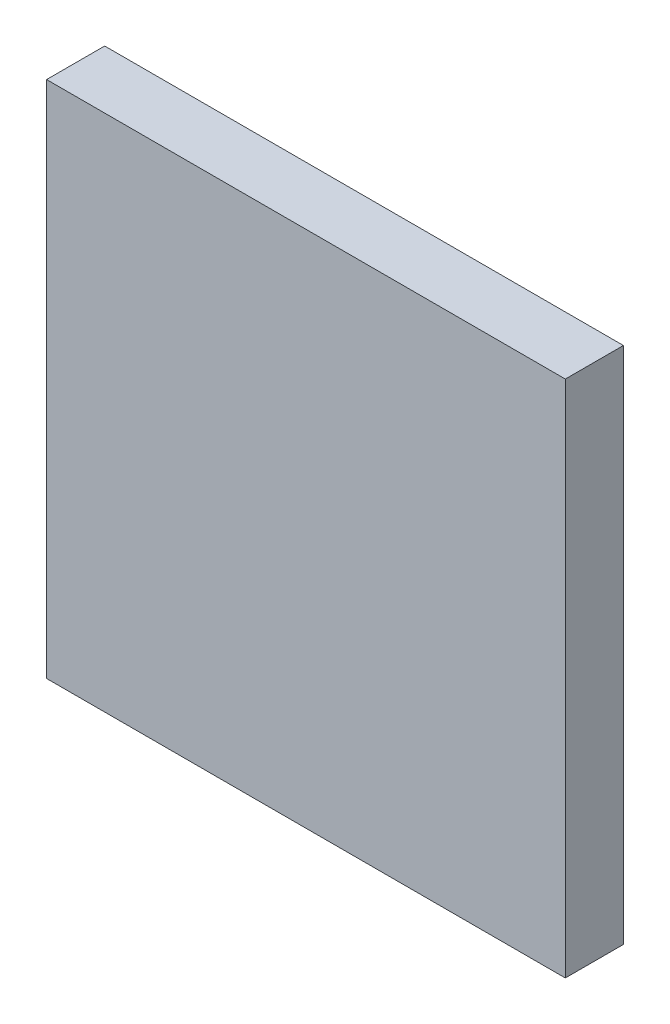
ISO-10303-21;
HEADER;
FILE_DESCRIPTION(('STEP AP214'),'2;1');
FILE_NAME('part.step','',(''),(''),'','','');
FILE_SCHEMA(('AUTOMOTIVE_DESIGN { 1 0 10303 214 1 1 1 1 }'));
ENDSEC;
DATA;
#1=APPLICATION_CONTEXT('core data for automotive mechanical design processes');
#2=APPLICATION_PROTOCOL_DEFINITION('international standard','automotive_design',2000,#1);
#3=PRODUCT_CONTEXT('',#1,'mechanical');
#4=PRODUCT('Part','Part','',(#3));
#5=PRODUCT_RELATED_PRODUCT_CATEGORY('part','',(#4));
#6=PRODUCT_DEFINITION_FORMATION('','',#4);
#7=PRODUCT_DEFINITION_CONTEXT('part definition',#1,'design');
#8=PRODUCT_DEFINITION('design','',#6,#7);
#9=PRODUCT_DEFINITION_SHAPE('','',#8);
#10=(LENGTH_UNIT() NAMED_UNIT(*) SI_UNIT(.MILLI.,.METRE.));
#11=(NAMED_UNIT(*) PLANE_ANGLE_UNIT() SI_UNIT($,.RADIAN.));
#12=(NAMED_UNIT(*) SI_UNIT($,.STERADIAN.) SOLID_ANGLE_UNIT());
#13=UNCERTAINTY_MEASURE_WITH_UNIT(LENGTH_MEASURE(1.E-05),#10,'distance_accuracy_value','');
#14=(GEOMETRIC_REPRESENTATION_CONTEXT(3) GLOBAL_UNCERTAINTY_ASSIGNED_CONTEXT((#13)) GLOBAL_UNIT_ASSIGNED_CONTEXT((#10,
#11,#12)) REPRESENTATION_CONTEXT('',''));
#15=CARTESIAN_POINT('',(0.,0.,0.));
#16=DIRECTION('',(0.,0.,1.));
#17=DIRECTION('',(1.,0.,0.));
#18=AXIS2_PLACEMENT_3D('',#15,#16,#17);
#19=CARTESIAN_POINT('',(0.,0.,0.));
#20=DIRECTION('',(0.,0.,1.));
#21=DIRECTION('',(1.,0.,0.));
#22=AXIS2_PLACEMENT_3D('',#19,#20,#21);
#23=PLANE('',#22);
#24=DIRECTION('',(0.,-1.,0.));
#25=VECTOR('',#24,1.);
#26=CARTESIAN_POINT('',(-0.635,-0.635,0.));
#27=LINE('',#26,#25);
#28=CARTESIAN_POINT('',(-0.635,5.03500009,0.));
#29=VERTEX_POINT('',#28);
#30=CARTESIAN_POINT('',(-0.635,-0.635,0.));
#31=VERTEX_POINT('',#30);
#32=EDGE_CURVE('E207',#29,#31,#27,.T.);
#33=ORIENTED_EDGE('',*,*,#32,.F.);
#34=DIRECTION('',(-1.,0.,0.));
#35=VECTOR('',#34,1.);
#36=CARTESIAN_POINT('',(5.03500009,5.03500009,0.));
#37=LINE('',#36,#35);
#38=CARTESIAN_POINT('',(5.03500009,5.03500009,0.));
#39=VERTEX_POINT('',#38);
#40=EDGE_CURVE('E201',#39,#29,#37,.T.);
#41=ORIENTED_EDGE('',*,*,#40,.F.);
#42=DIRECTION('',(0.,1.,0.));
#43=VECTOR('',#42,1.);
#44=CARTESIAN_POINT('',(5.03500009,-0.635,0.));
#45=LINE('',#44,#43);
#46=CARTESIAN_POINT('',(5.03500009,-0.635,0.));
#47=VERTEX_POINT('',#46);
#48=EDGE_CURVE('E210',#47,#39,#45,.T.);
#49=ORIENTED_EDGE('',*,*,#48,.F.);
#50=DIRECTION('',(1.,0.,0.));
#51=VECTOR('',#50,1.);
#52=CARTESIAN_POINT('',(5.03500009,-0.635,0.));
#53=LINE('',#52,#51);
#54=EDGE_CURVE('E193',#31,#47,#53,.T.);
#55=ORIENTED_EDGE('',*,*,#54,.F.);
#56=EDGE_LOOP('',(#33,#41,#49,#55));
#57=FACE_BOUND('',#56,.T.);
#58=DIRECTION('',(0.,-1.,0.));
#59=VECTOR('',#58,1.);
#60=CARTESIAN_POINT('',(4.40000008999999,0.,0.));
#61=LINE('',#60,#59);
#62=CARTESIAN_POINT('',(4.40000008999999,4.40000009,0.));
#63=VERTEX_POINT('',#62);
#64=CARTESIAN_POINT('',(4.40000008999999,3.520000072,0.));
#65=VERTEX_POINT('',#64);
#66=EDGE_CURVE('E11',#63,#65,#61,.T.);
#67=ORIENTED_EDGE('',*,*,#66,.F.);
#68=DIRECTION('',(1.,0.,0.));
#69=VECTOR('',#68,1.);
#70=CARTESIAN_POINT('',(0.,4.40000009,0.));
#71=LINE('',#70,#69);
#72=CARTESIAN_POINT('',(3.52000007199999,4.40000009,0.));
#73=VERTEX_POINT('',#72);
#74=EDGE_CURVE('E49',#73,#63,#71,.T.);
#75=ORIENTED_EDGE('',*,*,#74,.F.);
#76=DIRECTION('',(1.,0.,0.));
#77=VECTOR('',#76,1.);
#78=CARTESIAN_POINT('',(0.,4.40000009,0.));
#79=LINE('',#78,#77);
#80=CARTESIAN_POINT('',(2.64000005399999,4.40000009,0.));
#81=VERTEX_POINT('',#80);
#82=EDGE_CURVE('E402',#81,#73,#79,.T.);
#83=ORIENTED_EDGE('',*,*,#82,.F.);
#84=DIRECTION('',(1.,0.,0.));
#85=VECTOR('',#84,1.);
#86=CARTESIAN_POINT('',(0.,4.40000009,0.));
#87=LINE('',#86,#85);
#88=CARTESIAN_POINT('',(1.76000003599999,4.40000009,0.));
#89=VERTEX_POINT('',#88);
#90=EDGE_CURVE('E395',#89,#81,#87,.T.);
#91=ORIENTED_EDGE('',*,*,#90,.F.);
#92=DIRECTION('',(1.,0.,0.));
#93=VECTOR('',#92,1.);
#94=CARTESIAN_POINT('',(0.,4.40000009,0.));
#95=LINE('',#94,#93);
#96=CARTESIAN_POINT('',(0.880000017999987,4.40000009,0.));
#97=VERTEX_POINT('',#96);
#98=EDGE_CURVE('E384',#97,#89,#95,.T.);
#99=ORIENTED_EDGE('',*,*,#98,.F.);
#100=DIRECTION('',(1.,0.,0.));
#101=VECTOR('',#100,1.);
#102=CARTESIAN_POINT('',(0.,4.40000009,0.));
#103=LINE('',#102,#101);
#104=CARTESIAN_POINT('',(0.,4.40000009,0.));
#105=VERTEX_POINT('',#104);
#106=EDGE_CURVE('E385',#105,#97,#103,.T.);
#107=ORIENTED_EDGE('',*,*,#106,.F.);
#108=DIRECTION('',(0.,1.,0.));
#109=VECTOR('',#108,1.);
#110=CARTESIAN_POINT('',(0.,0.,0.));
#111=LINE('',#110,#109);
#112=CARTESIAN_POINT('',(0.,3.520000072,0.));
#113=VERTEX_POINT('',#112);
#114=EDGE_CURVE('E377',#113,#105,#111,.T.);
#115=ORIENTED_EDGE('',*,*,#114,.F.);
#116=DIRECTION('',(0.,1.,0.));
#117=VECTOR('',#116,1.);
#118=CARTESIAN_POINT('',(0.,0.,0.));
#119=LINE('',#118,#117);
#120=CARTESIAN_POINT('',(0.,2.640000054,0.));
#121=VERTEX_POINT('',#120);
#122=EDGE_CURVE('E344',#121,#113,#119,.T.);
#123=ORIENTED_EDGE('',*,*,#122,.F.);
#124=DIRECTION('',(0.,1.,0.));
#125=VECTOR('',#124,1.);
#126=CARTESIAN_POINT('',(0.,0.,0.));
#127=LINE('',#126,#125);
#128=CARTESIAN_POINT('',(0.,1.760000036,0.));
#129=VERTEX_POINT('',#128);
#130=EDGE_CURVE('E311',#129,#121,#127,.T.);
#131=ORIENTED_EDGE('',*,*,#130,.F.);
#132=DIRECTION('',(0.,1.,0.));
#133=VECTOR('',#132,1.);
#134=CARTESIAN_POINT('',(0.,0.,0.));
#135=LINE('',#134,#133);
#136=CARTESIAN_POINT('',(0.,0.880000018,0.));
#137=VERTEX_POINT('',#136);
#138=EDGE_CURVE('E280',#137,#129,#135,.T.);
#139=ORIENTED_EDGE('',*,*,#138,.F.);
#140=DIRECTION('',(0.,1.,0.));
#141=VECTOR('',#140,1.);
#142=CARTESIAN_POINT('',(0.,0.,0.));
#143=LINE('',#142,#141);
#144=CARTESIAN_POINT('',(0.,0.,0.));
#145=VERTEX_POINT('',#144);
#146=EDGE_CURVE('E243',#145,#137,#143,.T.);
#147=ORIENTED_EDGE('',*,*,#146,.F.);
#148=DIRECTION('',(-1.,0.,0.));
#149=VECTOR('',#148,1.);
#150=CARTESIAN_POINT('',(0.,0.,0.));
#151=LINE('',#150,#149);
#152=CARTESIAN_POINT('',(0.880000018,0.,0.));
#153=VERTEX_POINT('',#152);
#154=EDGE_CURVE('E239',#153,#145,#151,.T.);
#155=ORIENTED_EDGE('',*,*,#154,.F.);
#156=DIRECTION('',(-1.,0.,0.));
#157=VECTOR('',#156,1.);
#158=CARTESIAN_POINT('',(0.,0.,0.));
#159=LINE('',#158,#157);
#160=CARTESIAN_POINT('',(1.760000036,0.,0.));
#161=VERTEX_POINT('',#160);
#162=EDGE_CURVE('E255',#161,#153,#159,.T.);
#163=ORIENTED_EDGE('',*,*,#162,.F.);
#164=DIRECTION('',(-1.,0.,0.));
#165=VECTOR('',#164,1.);
#166=CARTESIAN_POINT('',(0.,0.,0.));
#167=LINE('',#166,#165);
#168=CARTESIAN_POINT('',(2.640000054,0.,0.));
#169=VERTEX_POINT('',#168);
#170=EDGE_CURVE('E266',#169,#161,#167,.T.);
#171=ORIENTED_EDGE('',*,*,#170,.F.);
#172=DIRECTION('',(-1.,0.,0.));
#173=VECTOR('',#172,1.);
#174=CARTESIAN_POINT('',(0.,0.,0.));
#175=LINE('',#174,#173);
#176=CARTESIAN_POINT('',(3.520000072,0.,0.));
#177=VERTEX_POINT('',#176);
#178=EDGE_CURVE('E296',#177,#169,#175,.T.);
#179=ORIENTED_EDGE('',*,*,#178,.F.);
#180=DIRECTION('',(-1.,0.,0.));
#181=VECTOR('',#180,1.);
#182=CARTESIAN_POINT('',(0.,0.,0.));
#183=LINE('',#182,#181);
#184=CARTESIAN_POINT('',(4.40000009,0.,0.));
#185=VERTEX_POINT('',#184);
#186=EDGE_CURVE('E414',#185,#177,#183,.T.);
#187=ORIENTED_EDGE('',*,*,#186,.F.);
#188=DIRECTION('',(0.,-1.,0.));
#189=VECTOR('',#188,1.);
#190=CARTESIAN_POINT('',(4.40000009,0.,0.));
#191=LINE('',#190,#189);
#192=CARTESIAN_POINT('',(4.40000009,0.880000018,0.));
#193=VERTEX_POINT('',#192);
#194=EDGE_CURVE('E418',#193,#185,#191,.T.);
#195=ORIENTED_EDGE('',*,*,#194,.F.);
#196=DIRECTION('',(0.,-1.,0.));
#197=VECTOR('',#196,1.);
#198=CARTESIAN_POINT('',(4.40000009,0.,0.));
#199=LINE('',#198,#197);
#200=CARTESIAN_POINT('',(4.40000009,1.760000036,0.));
#201=VERTEX_POINT('',#200);
#202=EDGE_CURVE('E425',#201,#193,#199,.T.);
#203=ORIENTED_EDGE('',*,*,#202,.F.);
#204=DIRECTION('',(0.,-1.,0.));
#205=VECTOR('',#204,1.);
#206=CARTESIAN_POINT('',(4.40000008999999,0.,0.));
#207=LINE('',#206,#205);
#208=CARTESIAN_POINT('',(4.40000008999999,2.640000054,0.));
#209=VERTEX_POINT('',#208);
#210=EDGE_CURVE('E432',#209,#201,#207,.T.);
#211=ORIENTED_EDGE('',*,*,#210,.F.);
#212=DIRECTION('',(0.,-1.,0.));
#213=VECTOR('',#212,1.);
#214=CARTESIAN_POINT('',(4.40000008999999,0.,0.));
#215=LINE('',#214,#213);
#216=EDGE_CURVE('E439',#65,#209,#215,.T.);
#217=ORIENTED_EDGE('',*,*,#216,.F.);
#218=EDGE_LOOP('',(#67,#75,#83,#91,#99,#107,#115,#123,#131,#139,#147,#155,#163,#171,#179,#187,
#195,#203,#211,#217));
#219=FACE_BOUND('',#218,.T.);
#220=ADVANCED_FACE('F45',(#57,#219),#23,.F.);
#221=ORIENTED_EDGE('',*,*,#74,.T.);
#222=ORIENTED_EDGE('',*,*,#66,.T.);
#223=DIRECTION('',(1.,0.,0.));
#224=VECTOR('',#223,1.);
#225=CARTESIAN_POINT('',(0.,3.520000072,0.));
#226=LINE('',#225,#224);
#227=CARTESIAN_POINT('',(3.52000007199999,3.520000072,0.));
#228=VERTEX_POINT('',#227);
#229=EDGE_CURVE('E435',#228,#65,#226,.T.);
#230=ORIENTED_EDGE('',*,*,#229,.F.);
#231=DIRECTION('',(0.,-1.,0.));
#232=VECTOR('',#231,1.);
#233=CARTESIAN_POINT('',(3.52000007199999,0.,0.));
#234=LINE('',#233,#232);
#235=EDGE_CURVE('E406',#73,#228,#234,.T.);
#236=ORIENTED_EDGE('',*,*,#235,.F.);
#237=EDGE_LOOP('',(#221,#222,#230,#236));
#238=FACE_BOUND('',#237,.T.);
#239=ADVANCED_FACE('F451',(#238),#23,.F.);
#240=ORIENTED_EDGE('',*,*,#229,.T.);
#241=ORIENTED_EDGE('',*,*,#216,.T.);
#242=DIRECTION('',(1.,0.,0.));
#243=VECTOR('',#242,1.);
#244=CARTESIAN_POINT('',(0.,2.640000054,0.));
#245=LINE('',#244,#243);
#246=CARTESIAN_POINT('',(3.52000007199999,2.640000054,0.));
#247=VERTEX_POINT('',#246);
#248=EDGE_CURVE('E428',#247,#209,#245,.T.);
#249=ORIENTED_EDGE('',*,*,#248,.F.);
#250=DIRECTION('',(0.,-1.,0.));
#251=VECTOR('',#250,1.);
#252=CARTESIAN_POINT('',(3.52000007199999,0.,0.));
#253=LINE('',#252,#251);
#254=EDGE_CURVE('E373',#228,#247,#253,.T.);
#255=ORIENTED_EDGE('',*,*,#254,.F.);
#256=EDGE_LOOP('',(#240,#241,#249,#255));
#257=FACE_BOUND('',#256,.T.);
#258=ADVANCED_FACE('F448',(#257),#23,.F.);
#259=ORIENTED_EDGE('',*,*,#248,.T.);
#260=ORIENTED_EDGE('',*,*,#210,.T.);
#261=DIRECTION('',(1.,0.,0.));
#262=VECTOR('',#261,1.);
#263=CARTESIAN_POINT('',(0.,1.760000036,0.));
#264=LINE('',#263,#262);
#265=CARTESIAN_POINT('',(3.520000072,1.760000036,0.));
#266=VERTEX_POINT('',#265);
#267=EDGE_CURVE('E417',#266,#201,#264,.T.);
#268=ORIENTED_EDGE('',*,*,#267,.F.);
#269=DIRECTION('',(0.,-1.,0.));
#270=VECTOR('',#269,1.);
#271=CARTESIAN_POINT('',(3.52000007199999,0.,0.));
#272=LINE('',#271,#270);
#273=EDGE_CURVE('E340',#247,#266,#272,.T.);
#274=ORIENTED_EDGE('',*,*,#273,.F.);
#275=EDGE_LOOP('',(#259,#260,#268,#274));
#276=FACE_BOUND('',#275,.T.);
#277=ADVANCED_FACE('F518',(#276),#23,.F.);
#278=ORIENTED_EDGE('',*,*,#267,.T.);
#279=ORIENTED_EDGE('',*,*,#202,.T.);
#280=DIRECTION('',(1.,0.,0.));
#281=VECTOR('',#280,1.);
#282=CARTESIAN_POINT('',(0.,0.880000018,0.));
#283=LINE('',#282,#281);
#284=CARTESIAN_POINT('',(3.520000072,0.880000018,0.));
#285=VERTEX_POINT('',#284);
#286=EDGE_CURVE('E410',#285,#193,#283,.T.);
#287=ORIENTED_EDGE('',*,*,#286,.F.);
#288=DIRECTION('',(0.,-1.,0.));
#289=VECTOR('',#288,1.);
#290=CARTESIAN_POINT('',(3.520000072,0.,0.));
#291=LINE('',#290,#289);
#292=EDGE_CURVE('E307',#266,#285,#291,.T.);
#293=ORIENTED_EDGE('',*,*,#292,.F.);
#294=EDGE_LOOP('',(#278,#279,#287,#293));
#295=FACE_BOUND('',#294,.T.);
#296=ADVANCED_FACE('F515',(#295),#23,.F.);
#297=ORIENTED_EDGE('',*,*,#194,.T.);
#298=ORIENTED_EDGE('',*,*,#186,.T.);
#299=DIRECTION('',(0.,-1.,0.));
#300=VECTOR('',#299,1.);
#301=CARTESIAN_POINT('',(3.520000072,0.,0.));
#302=LINE('',#301,#300);
#303=EDGE_CURVE('E292',#285,#177,#302,.T.);
#304=ORIENTED_EDGE('',*,*,#303,.F.);
#305=ORIENTED_EDGE('',*,*,#286,.T.);
#306=EDGE_LOOP('',(#297,#298,#304,#305));
#307=FACE_BOUND('',#306,.T.);
#308=ADVANCED_FACE('F510',(#307),#23,.F.);
#309=ORIENTED_EDGE('',*,*,#82,.T.);
#310=ORIENTED_EDGE('',*,*,#235,.T.);
#311=DIRECTION('',(1.,0.,0.));
#312=VECTOR('',#311,1.);
#313=CARTESIAN_POINT('',(0.,3.520000072,0.));
#314=LINE('',#313,#312);
#315=CARTESIAN_POINT('',(2.64000005399999,3.520000072,0.));
#316=VERTEX_POINT('',#315);
#317=EDGE_CURVE('E369',#316,#228,#314,.T.);
#318=ORIENTED_EDGE('',*,*,#317,.F.);
#319=DIRECTION('',(0.,-1.,0.));
#320=VECTOR('',#319,1.);
#321=CARTESIAN_POINT('',(2.64000005399999,0.,0.));
#322=LINE('',#321,#320);
#323=EDGE_CURVE('E399',#81,#316,#322,.T.);
#324=ORIENTED_EDGE('',*,*,#323,.F.);
#325=EDGE_LOOP('',(#309,#310,#318,#324));
#326=FACE_BOUND('',#325,.T.);
#327=ADVANCED_FACE('F454',(#326),#23,.F.);
#328=ORIENTED_EDGE('',*,*,#90,.T.);
#329=ORIENTED_EDGE('',*,*,#323,.T.);
#330=DIRECTION('',(1.,0.,0.));
#331=VECTOR('',#330,1.);
#332=CARTESIAN_POINT('',(0.,3.520000072,0.));
#333=LINE('',#332,#331);
#334=CARTESIAN_POINT('',(1.76000003599999,3.520000072,0.));
#335=VERTEX_POINT('',#334);
#336=EDGE_CURVE('E362',#335,#316,#333,.T.);
#337=ORIENTED_EDGE('',*,*,#336,.F.);
#338=DIRECTION('',(0.,-1.,0.));
#339=VECTOR('',#338,1.);
#340=CARTESIAN_POINT('',(1.76000003599999,0.,0.));
#341=LINE('',#340,#339);
#342=EDGE_CURVE('E392',#89,#335,#341,.T.);
#343=ORIENTED_EDGE('',*,*,#342,.F.);
#344=EDGE_LOOP('',(#328,#329,#337,#343));
#345=FACE_BOUND('',#344,.T.);
#346=ADVANCED_FACE('F468',(#345),#23,.F.);
#347=ORIENTED_EDGE('',*,*,#98,.T.);
#348=ORIENTED_EDGE('',*,*,#342,.T.);
#349=DIRECTION('',(1.,0.,0.));
#350=VECTOR('',#349,1.);
#351=CARTESIAN_POINT('',(0.,3.520000072,0.));
#352=LINE('',#351,#350);
#353=CARTESIAN_POINT('',(0.88000001799999,3.520000072,0.));
#354=VERTEX_POINT('',#353);
#355=EDGE_CURVE('E351',#354,#335,#352,.T.);
#356=ORIENTED_EDGE('',*,*,#355,.F.);
#357=DIRECTION('',(0.,-1.,0.));
#358=VECTOR('',#357,1.);
#359=CARTESIAN_POINT('',(0.880000017999987,0.,0.));
#360=LINE('',#359,#358);
#361=EDGE_CURVE('E381',#97,#354,#360,.T.);
#362=ORIENTED_EDGE('',*,*,#361,.F.);
#363=EDGE_LOOP('',(#347,#348,#356,#362));
#364=FACE_BOUND('',#363,.T.);
#365=ADVANCED_FACE('F472',(#364),#23,.F.);
#366=ORIENTED_EDGE('',*,*,#106,.T.);
#367=ORIENTED_EDGE('',*,*,#361,.T.);
#368=DIRECTION('',(1.,0.,0.));
#369=VECTOR('',#368,1.);
#370=CARTESIAN_POINT('',(0.,3.520000072,0.));
#371=LINE('',#370,#369);
#372=EDGE_CURVE('E352',#113,#354,#371,.T.);
#373=ORIENTED_EDGE('',*,*,#372,.F.);
#374=ORIENTED_EDGE('',*,*,#114,.T.);
#375=EDGE_LOOP('',(#366,#367,#373,#374));
#376=FACE_BOUND('',#375,.T.);
#377=ADVANCED_FACE('F476',(#376),#23,.F.);
#378=ORIENTED_EDGE('',*,*,#317,.T.);
#379=ORIENTED_EDGE('',*,*,#254,.T.);
#380=DIRECTION('',(1.,0.,0.));
#381=VECTOR('',#380,1.);
#382=CARTESIAN_POINT('',(0.,2.640000054,0.));
#383=LINE('',#382,#381);
#384=CARTESIAN_POINT('',(2.64000005399999,2.640000054,0.));
#385=VERTEX_POINT('',#384);
#386=EDGE_CURVE('E336',#385,#247,#383,.T.);
#387=ORIENTED_EDGE('',*,*,#386,.F.);
#388=DIRECTION('',(0.,-1.,0.));
#389=VECTOR('',#388,1.);
#390=CARTESIAN_POINT('',(2.64000005399999,0.,0.));
#391=LINE('',#390,#389);
#392=EDGE_CURVE('E366',#316,#385,#391,.T.);
#393=ORIENTED_EDGE('',*,*,#392,.F.);
#394=EDGE_LOOP('',(#378,#379,#387,#393));
#395=FACE_BOUND('',#394,.T.);
#396=ADVANCED_FACE('F526',(#395),#23,.F.);
#397=ORIENTED_EDGE('',*,*,#336,.T.);
#398=ORIENTED_EDGE('',*,*,#392,.T.);
#399=DIRECTION('',(1.,0.,0.));
#400=VECTOR('',#399,1.);
#401=CARTESIAN_POINT('',(0.,2.640000054,0.));
#402=LINE('',#401,#400);
#403=CARTESIAN_POINT('',(1.76000003599999,2.640000054,0.));
#404=VERTEX_POINT('',#403);
#405=EDGE_CURVE('E329',#404,#385,#402,.T.);
#406=ORIENTED_EDGE('',*,*,#405,.F.);
#407=DIRECTION('',(0.,-1.,0.));
#408=VECTOR('',#407,1.);
#409=CARTESIAN_POINT('',(1.76000003599999,0.,0.));
#410=LINE('',#409,#408);
#411=EDGE_CURVE('E359',#335,#404,#410,.T.);
#412=ORIENTED_EDGE('',*,*,#411,.F.);
#413=EDGE_LOOP('',(#397,#398,#406,#412));
#414=FACE_BOUND('',#413,.T.);
#415=ADVANCED_FACE('F529',(#414),#23,.F.);
#416=ORIENTED_EDGE('',*,*,#355,.T.);
#417=ORIENTED_EDGE('',*,*,#411,.T.);
#418=DIRECTION('',(1.,0.,0.));
#419=VECTOR('',#418,1.);
#420=CARTESIAN_POINT('',(0.,2.640000054,0.));
#421=LINE('',#420,#419);
#422=CARTESIAN_POINT('',(0.880000017999994,2.640000054,0.));
#423=VERTEX_POINT('',#422);
#424=EDGE_CURVE('E318',#423,#404,#421,.T.);
#425=ORIENTED_EDGE('',*,*,#424,.F.);
#426=DIRECTION('',(0.,-1.,0.));
#427=VECTOR('',#426,1.);
#428=CARTESIAN_POINT('',(0.88000001799999,0.,0.));
#429=LINE('',#428,#427);
#430=EDGE_CURVE('E348',#354,#423,#429,.T.);
#431=ORIENTED_EDGE('',*,*,#430,.F.);
#432=EDGE_LOOP('',(#416,#417,#425,#431));
#433=FACE_BOUND('',#432,.T.);
#434=ADVANCED_FACE('F532',(#433),#23,.F.);
#435=ORIENTED_EDGE('',*,*,#372,.T.);
#436=ORIENTED_EDGE('',*,*,#430,.T.);
#437=DIRECTION('',(1.,0.,0.));
#438=VECTOR('',#437,1.);
#439=CARTESIAN_POINT('',(0.,2.640000054,0.));
#440=LINE('',#439,#438);
#441=EDGE_CURVE('E319',#121,#423,#440,.T.);
#442=ORIENTED_EDGE('',*,*,#441,.F.);
#443=ORIENTED_EDGE('',*,*,#122,.T.);
#444=EDGE_LOOP('',(#435,#436,#442,#443));
#445=FACE_BOUND('',#444,.T.);
#446=ADVANCED_FACE('F479',(#445),#23,.F.);
#447=ORIENTED_EDGE('',*,*,#386,.T.);
#448=ORIENTED_EDGE('',*,*,#273,.T.);
#449=DIRECTION('',(1.,0.,0.));
#450=VECTOR('',#449,1.);
#451=CARTESIAN_POINT('',(0.,1.760000036,0.));
#452=LINE('',#451,#450);
#453=CARTESIAN_POINT('',(2.640000054,1.760000036,0.));
#454=VERTEX_POINT('',#453);
#455=EDGE_CURVE('E303',#454,#266,#452,.T.);
#456=ORIENTED_EDGE('',*,*,#455,.F.);
#457=DIRECTION('',(0.,-1.,0.));
#458=VECTOR('',#457,1.);
#459=CARTESIAN_POINT('',(2.64000005399999,0.,0.));
#460=LINE('',#459,#458);
#461=EDGE_CURVE('E333',#385,#454,#460,.T.);
#462=ORIENTED_EDGE('',*,*,#461,.F.);
#463=EDGE_LOOP('',(#447,#448,#456,#462));
#464=FACE_BOUND('',#463,.T.);
#465=ADVANCED_FACE('F521',(#464),#23,.F.);
#466=ORIENTED_EDGE('',*,*,#405,.T.);
#467=ORIENTED_EDGE('',*,*,#461,.T.);
#468=DIRECTION('',(1.,0.,0.));
#469=VECTOR('',#468,1.);
#470=CARTESIAN_POINT('',(0.,1.760000036,0.));
#471=LINE('',#470,#469);
#472=CARTESIAN_POINT('',(1.760000036,1.760000036,0.));
#473=VERTEX_POINT('',#472);
#474=EDGE_CURVE('E299',#473,#454,#471,.T.);
#475=ORIENTED_EDGE('',*,*,#474,.F.);
#476=DIRECTION('',(0.,-1.,0.));
#477=VECTOR('',#476,1.);
#478=CARTESIAN_POINT('',(1.76000003599999,0.,0.));
#479=LINE('',#478,#477);
#480=EDGE_CURVE('E326',#404,#473,#479,.T.);
#481=ORIENTED_EDGE('',*,*,#480,.F.);
#482=EDGE_LOOP('',(#466,#467,#475,#481));
#483=FACE_BOUND('',#482,.T.);
#484=ADVANCED_FACE('F538',(#483),#23,.F.);
#485=ORIENTED_EDGE('',*,*,#424,.T.);
#486=ORIENTED_EDGE('',*,*,#480,.T.);
#487=DIRECTION('',(1.,0.,0.));
#488=VECTOR('',#487,1.);
#489=CARTESIAN_POINT('',(0.,1.760000036,0.));
#490=LINE('',#489,#488);
#491=CARTESIAN_POINT('',(0.880000017999997,1.760000036,0.));
#492=VERTEX_POINT('',#491);
#493=EDGE_CURVE('E273',#492,#473,#490,.T.);
#494=ORIENTED_EDGE('',*,*,#493,.F.);
#495=DIRECTION('',(0.,-1.,0.));
#496=VECTOR('',#495,1.);
#497=CARTESIAN_POINT('',(0.880000017999994,0.,0.));
#498=LINE('',#497,#496);
#499=EDGE_CURVE('E315',#423,#492,#498,.T.);
#500=ORIENTED_EDGE('',*,*,#499,.F.);
#501=EDGE_LOOP('',(#485,#486,#494,#500));
#502=FACE_BOUND('',#501,.T.);
#503=ADVANCED_FACE('F535',(#502),#23,.F.);
#504=ORIENTED_EDGE('',*,*,#441,.T.);
#505=ORIENTED_EDGE('',*,*,#499,.T.);
#506=DIRECTION('',(1.,0.,0.));
#507=VECTOR('',#506,1.);
#508=CARTESIAN_POINT('',(0.,1.760000036,0.));
#509=LINE('',#508,#507);
#510=EDGE_CURVE('E284',#129,#492,#509,.T.);
#511=ORIENTED_EDGE('',*,*,#510,.F.);
#512=ORIENTED_EDGE('',*,*,#130,.T.);
#513=EDGE_LOOP('',(#504,#505,#511,#512));
#514=FACE_BOUND('',#513,.T.);
#515=ADVANCED_FACE('F483',(#514),#23,.F.);
#516=ORIENTED_EDGE('',*,*,#455,.T.);
#517=ORIENTED_EDGE('',*,*,#292,.T.);
#518=DIRECTION('',(1.,0.,0.));
#519=VECTOR('',#518,1.);
#520=CARTESIAN_POINT('',(0.,0.880000018,0.));
#521=LINE('',#520,#519);
#522=CARTESIAN_POINT('',(2.640000054,0.880000018,0.));
#523=VERTEX_POINT('',#522);
#524=EDGE_CURVE('E288',#523,#285,#521,.T.);
#525=ORIENTED_EDGE('',*,*,#524,.F.);
#526=DIRECTION('',(0.,-1.,0.));
#527=VECTOR('',#526,1.);
#528=CARTESIAN_POINT('',(2.640000054,0.,0.));
#529=LINE('',#528,#527);
#530=EDGE_CURVE('E300',#454,#523,#529,.T.);
#531=ORIENTED_EDGE('',*,*,#530,.F.);
#532=EDGE_LOOP('',(#516,#517,#525,#531));
#533=FACE_BOUND('',#532,.T.);
#534=ADVANCED_FACE('F542',(#533),#23,.F.);
#535=ORIENTED_EDGE('',*,*,#474,.T.);
#536=ORIENTED_EDGE('',*,*,#530,.T.);
#537=DIRECTION('',(1.,0.,0.));
#538=VECTOR('',#537,1.);
#539=CARTESIAN_POINT('',(0.,0.880000018,0.));
#540=LINE('',#539,#538);
#541=CARTESIAN_POINT('',(1.760000036,0.880000018,0.));
#542=VERTEX_POINT('',#541);
#543=EDGE_CURVE('E258',#542,#523,#540,.T.);
#544=ORIENTED_EDGE('',*,*,#543,.F.);
#545=DIRECTION('',(0.,-1.,0.));
#546=VECTOR('',#545,1.);
#547=CARTESIAN_POINT('',(1.760000036,0.,0.));
#548=LINE('',#547,#546);
#549=EDGE_CURVE('E277',#473,#542,#548,.T.);
#550=ORIENTED_EDGE('',*,*,#549,.F.);
#551=EDGE_LOOP('',(#535,#536,#544,#550));
#552=FACE_BOUND('',#551,.T.);
#553=ADVANCED_FACE('F540',(#552),#23,.F.);
#554=ORIENTED_EDGE('',*,*,#303,.T.);
#555=ORIENTED_EDGE('',*,*,#178,.T.);
#556=DIRECTION('',(0.,-1.,0.));
#557=VECTOR('',#556,1.);
#558=CARTESIAN_POINT('',(2.640000054,0.,0.));
#559=LINE('',#558,#557);
#560=EDGE_CURVE('E262',#523,#169,#559,.T.);
#561=ORIENTED_EDGE('',*,*,#560,.F.);
#562=ORIENTED_EDGE('',*,*,#524,.T.);
#563=EDGE_LOOP('',(#554,#555,#561,#562));
#564=FACE_BOUND('',#563,.T.);
#565=ADVANCED_FACE('F506',(#564),#23,.F.);
#566=ORIENTED_EDGE('',*,*,#138,.T.);
#567=ORIENTED_EDGE('',*,*,#510,.T.);
#568=DIRECTION('',(0.,1.,0.));
#569=VECTOR('',#568,1.);
#570=CARTESIAN_POINT('',(0.880000017999997,0.,0.));
#571=LINE('',#570,#569);
#572=CARTESIAN_POINT('',(0.880000018,0.880000018,0.));
#573=VERTEX_POINT('',#572);
#574=EDGE_CURVE('E269',#573,#492,#571,.T.);
#575=ORIENTED_EDGE('',*,*,#574,.F.);
#576=DIRECTION('',(1.,0.,0.));
#577=VECTOR('',#576,1.);
#578=CARTESIAN_POINT('',(0.,0.880000018,0.));
#579=LINE('',#578,#577);
#580=EDGE_CURVE('E228',#137,#573,#579,.T.);
#581=ORIENTED_EDGE('',*,*,#580,.F.);
#582=EDGE_LOOP('',(#566,#567,#575,#581));
#583=FACE_BOUND('',#582,.T.);
#584=ADVANCED_FACE('F488',(#583),#23,.F.);
#585=ORIENTED_EDGE('',*,*,#493,.T.);
#586=ORIENTED_EDGE('',*,*,#549,.T.);
#587=DIRECTION('',(1.,0.,0.));
#588=VECTOR('',#587,1.);
#589=CARTESIAN_POINT('',(0.,0.880000018,0.));
#590=LINE('',#589,#588);
#591=EDGE_CURVE('E247',#573,#542,#590,.T.);
#592=ORIENTED_EDGE('',*,*,#591,.F.);
#593=ORIENTED_EDGE('',*,*,#574,.T.);
#594=EDGE_LOOP('',(#585,#586,#592,#593));
#595=FACE_BOUND('',#594,.T.);
#596=ADVANCED_FACE('F493',(#595),#23,.F.);
#597=ORIENTED_EDGE('',*,*,#560,.T.);
#598=ORIENTED_EDGE('',*,*,#170,.T.);
#599=DIRECTION('',(0.,-1.,0.));
#600=VECTOR('',#599,1.);
#601=CARTESIAN_POINT('',(1.760000036,0.,0.));
#602=LINE('',#601,#600);
#603=EDGE_CURVE('E251',#542,#161,#602,.T.);
#604=ORIENTED_EDGE('',*,*,#603,.F.);
#605=ORIENTED_EDGE('',*,*,#543,.T.);
#606=EDGE_LOOP('',(#597,#598,#604,#605));
#607=FACE_BOUND('',#606,.T.);
#608=ADVANCED_FACE('F504',(#607),#23,.F.);
#609=ORIENTED_EDGE('',*,*,#603,.T.);
#610=ORIENTED_EDGE('',*,*,#162,.T.);
#611=DIRECTION('',(0.,-1.,0.));
#612=VECTOR('',#611,1.);
#613=CARTESIAN_POINT('',(0.880000018,0.,0.));
#614=LINE('',#613,#612);
#615=EDGE_CURVE('E235',#573,#153,#614,.T.);
#616=ORIENTED_EDGE('',*,*,#615,.F.);
#617=ORIENTED_EDGE('',*,*,#591,.T.);
#618=EDGE_LOOP('',(#609,#610,#616,#617));
#619=FACE_BOUND('',#618,.T.);
#620=ADVANCED_FACE('F497',(#619),#23,.F.);
#621=CARTESIAN_POINT('',(-0.635,-0.635,0.));
#622=DIRECTION('',(-1.,0.,0.));
#623=DIRECTION('',(0.,0.,1.));
#624=AXIS2_PLACEMENT_3D('',#621,#622,#623);
#625=PLANE('',#624);
#626=DIRECTION('',(0.,-1.,0.));
#627=VECTOR('',#626,1.);
#628=CARTESIAN_POINT('',(-0.635,-0.635,0.635));
#629=LINE('',#628,#627);
#630=CARTESIAN_POINT('',(-0.635,5.03500009,0.635));
#631=VERTEX_POINT('',#630);
#632=CARTESIAN_POINT('',(-0.635,-0.635,0.635));
#633=VERTEX_POINT('',#632);
#634=EDGE_CURVE('E222',#631,#633,#629,.T.);
#635=ORIENTED_EDGE('',*,*,#634,.F.);
#636=DIRECTION('',(0.,0.,1.));
#637=VECTOR('',#636,1.);
#638=CARTESIAN_POINT('',(-0.635,5.03500009,0.));
#639=LINE('',#638,#637);
#640=EDGE_CURVE('E213',#29,#631,#639,.T.);
#641=ORIENTED_EDGE('',*,*,#640,.F.);
#642=ORIENTED_EDGE('',*,*,#32,.T.);
#643=DIRECTION('',(0.,0.,1.));
#644=VECTOR('',#643,1.);
#645=CARTESIAN_POINT('',(-0.635,-0.635,0.));
#646=LINE('',#645,#644);
#647=EDGE_CURVE('E190',#31,#633,#646,.T.);
#648=ORIENTED_EDGE('',*,*,#647,.T.);
#649=EDGE_LOOP('',(#635,#641,#642,#648));
#650=FACE_BOUND('',#649,.T.);
#651=ADVANCED_FACE('F212',(#650),#625,.T.);
#652=CARTESIAN_POINT('',(5.03500009,5.03500009,0.));
#653=DIRECTION('',(0.,1.,0.));
#654=DIRECTION('',(0.,0.,1.));
#655=AXIS2_PLACEMENT_3D('',#652,#653,#654);
#656=PLANE('',#655);
#657=DIRECTION('',(-1.,0.,0.));
#658=VECTOR('',#657,1.);
#659=CARTESIAN_POINT('',(5.03500009,5.03500009,0.635));
#660=LINE('',#659,#658);
#661=CARTESIAN_POINT('',(5.03500009,5.03500009,0.635));
#662=VERTEX_POINT('',#661);
#663=EDGE_CURVE('E214',#662,#631,#660,.T.);
#664=ORIENTED_EDGE('',*,*,#663,.F.);
#665=DIRECTION('',(0.,0.,1.));
#666=VECTOR('',#665,1.);
#667=CARTESIAN_POINT('',(5.03500009,5.03500009,0.));
#668=LINE('',#667,#666);
#669=EDGE_CURVE('E229',#39,#662,#668,.T.);
#670=ORIENTED_EDGE('',*,*,#669,.F.);
#671=ORIENTED_EDGE('',*,*,#40,.T.);
#672=ORIENTED_EDGE('',*,*,#640,.T.);
#673=EDGE_LOOP('',(#664,#670,#671,#672));
#674=FACE_BOUND('',#673,.T.);
#675=ADVANCED_FACE('F563',(#674),#656,.T.);
#676=CARTESIAN_POINT('',(5.03500009,-0.635,0.));
#677=DIRECTION('',(1.,0.,0.));
#678=DIRECTION('',(0.,1.,0.));
#679=AXIS2_PLACEMENT_3D('',#676,#677,#678);
#680=PLANE('',#679);
#681=DIRECTION('',(0.,1.,0.));
#682=VECTOR('',#681,1.);
#683=CARTESIAN_POINT('',(5.03500009,-0.635,0.635));
#684=LINE('',#683,#682);
#685=CARTESIAN_POINT('',(5.03500009,-0.635,0.635));
#686=VERTEX_POINT('',#685);
#687=EDGE_CURVE('E217',#686,#662,#684,.T.);
#688=ORIENTED_EDGE('',*,*,#687,.F.);
#689=DIRECTION('',(0.,0.,1.));
#690=VECTOR('',#689,1.);
#691=CARTESIAN_POINT('',(5.03500009,-0.635,0.));
#692=LINE('',#691,#690);
#693=EDGE_CURVE('E200',#47,#686,#692,.T.);
#694=ORIENTED_EDGE('',*,*,#693,.F.);
#695=ORIENTED_EDGE('',*,*,#48,.T.);
#696=ORIENTED_EDGE('',*,*,#669,.T.);
#697=EDGE_LOOP('',(#688,#694,#695,#696));
#698=FACE_BOUND('',#697,.T.);
#699=ADVANCED_FACE('F737',(#698),#680,.T.);
#700=CARTESIAN_POINT('',(5.03500009,-0.635,0.));
#701=DIRECTION('',(0.,-1.,0.));
#702=DIRECTION('',(0.,0.,-1.));
#703=AXIS2_PLACEMENT_3D('',#700,#701,#702);
#704=PLANE('',#703);
#705=DIRECTION('',(1.,0.,0.));
#706=VECTOR('',#705,1.);
#707=CARTESIAN_POINT('',(5.03500009,-0.635,0.635));
#708=LINE('',#707,#706);
#709=EDGE_CURVE('E195',#633,#686,#708,.T.);
#710=ORIENTED_EDGE('',*,*,#709,.F.);
#711=ORIENTED_EDGE('',*,*,#647,.F.);
#712=ORIENTED_EDGE('',*,*,#54,.T.);
#713=ORIENTED_EDGE('',*,*,#693,.T.);
#714=EDGE_LOOP('',(#710,#711,#712,#713));
#715=FACE_BOUND('',#714,.T.);
#716=ADVANCED_FACE('F192',(#715),#704,.T.);
#717=CARTESIAN_POINT('',(0.,0.,0.635));
#718=DIRECTION('',(0.,0.,1.));
#719=DIRECTION('',(1.,0.,0.));
#720=AXIS2_PLACEMENT_3D('',#717,#718,#719);
#721=PLANE('',#720);
#722=ORIENTED_EDGE('',*,*,#634,.T.);
#723=ORIENTED_EDGE('',*,*,#709,.T.);
#724=ORIENTED_EDGE('',*,*,#687,.T.);
#725=ORIENTED_EDGE('',*,*,#663,.T.);
#726=EDGE_LOOP('',(#722,#723,#724,#725));
#727=FACE_BOUND('',#726,.T.);
#728=ADVANCED_FACE('F554',(#727),#721,.T.);
#729=ORIENTED_EDGE('',*,*,#154,.T.);
#730=ORIENTED_EDGE('',*,*,#146,.T.);
#731=ORIENTED_EDGE('',*,*,#580,.T.);
#732=ORIENTED_EDGE('',*,*,#615,.T.);
#733=EDGE_LOOP('',(#729,#730,#731,#732));
#734=FACE_BOUND('',#733,.T.);
#735=ADVANCED_FACE('F47',(#734),#23,.F.);
#736=CLOSED_SHELL('',(#220,#239,#258,#277,#296,#308,#327,#346,#365,#377,#396,#415,#434,#446,
#465,#484,#503,#515,#534,#553,#565,#584,#596,#608,#620,#651,#675,#699,#716,#728,#735));
#737=MANIFOLD_SOLID_BREP('B2',#736);
#738=ADVANCED_BREP_SHAPE_REPRESENTATION('',(#18,#737),#14);
#739=SHAPE_DEFINITION_REPRESENTATION(#9,#738);
ENDSEC;
END-ISO-10303-21;
